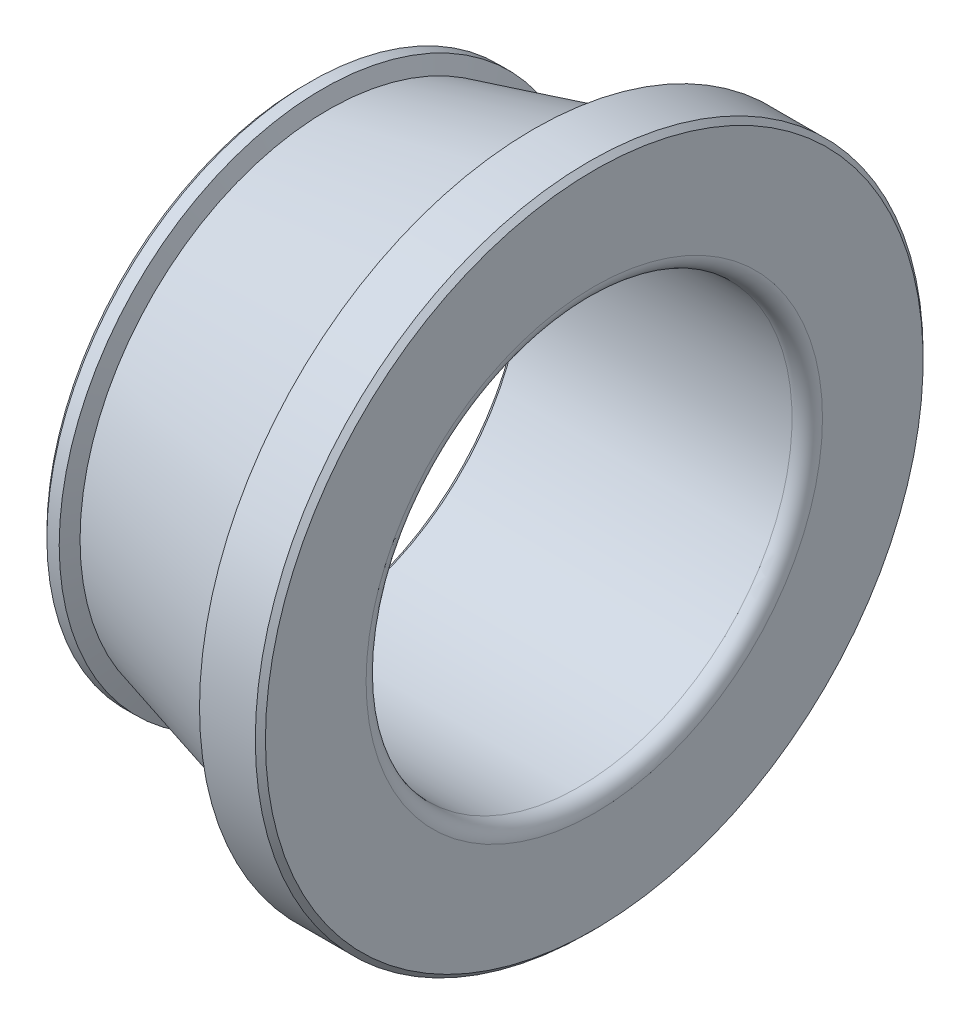
ISO-10303-21;
HEADER;
FILE_DESCRIPTION(('STEP AP214'),'2;1');
FILE_NAME('part.step','',(''),(''),'','','');
FILE_SCHEMA(('AUTOMOTIVE_DESIGN { 1 0 10303 214 1 1 1 1 }'));
ENDSEC;
DATA;
#1=APPLICATION_CONTEXT('core data for automotive mechanical design processes');
#2=APPLICATION_PROTOCOL_DEFINITION('international standard','automotive_design',2000,#1);
#3=PRODUCT_CONTEXT('',#1,'mechanical');
#4=PRODUCT('Part','Part','',(#3));
#5=PRODUCT_RELATED_PRODUCT_CATEGORY('part','',(#4));
#6=PRODUCT_DEFINITION_FORMATION('','',#4);
#7=PRODUCT_DEFINITION_CONTEXT('part definition',#1,'design');
#8=PRODUCT_DEFINITION('design','',#6,#7);
#9=PRODUCT_DEFINITION_SHAPE('','',#8);
#10=(LENGTH_UNIT() NAMED_UNIT(*) SI_UNIT(.MILLI.,.METRE.));
#11=(NAMED_UNIT(*) PLANE_ANGLE_UNIT() SI_UNIT($,.RADIAN.));
#12=(NAMED_UNIT(*) SI_UNIT($,.STERADIAN.) SOLID_ANGLE_UNIT());
#13=UNCERTAINTY_MEASURE_WITH_UNIT(LENGTH_MEASURE(1.E-05),#10,'distance_accuracy_value','');
#14=(GEOMETRIC_REPRESENTATION_CONTEXT(3) GLOBAL_UNCERTAINTY_ASSIGNED_CONTEXT((#13)) GLOBAL_UNIT_ASSIGNED_CONTEXT((#10,
#11,#12)) REPRESENTATION_CONTEXT('',''));
#15=CARTESIAN_POINT('',(0.,0.,0.));
#16=DIRECTION('',(0.,0.,1.));
#17=DIRECTION('',(1.,0.,0.));
#18=AXIS2_PLACEMENT_3D('',#15,#16,#17);
#19=CARTESIAN_POINT('',(1.25,-17.2996703748551,-16.984166666667));
#20=DIRECTION('',(-1.,0.,0.));
#21=DIRECTION('',(0.,0.,1.));
#22=AXIS2_PLACEMENT_3D('',#19,#20,#21);
#23=PLANE('',#22);
#24=CARTESIAN_POINT('',(1.25,0.,0.));
#25=DIRECTION('',(-1.,0.,0.));
#26=DIRECTION('',(0.,0.,-1.));
#27=AXIS2_PLACEMENT_3D('',#24,#25,#26);
#28=CIRCLE('',#27,16.984166666667);
#29=CARTESIAN_POINT('',(1.25,0.,-16.984166666667));
#30=VERTEX_POINT('',#29);
#31=EDGE_CURVE('E56',#30,#30,#28,.F.);
#32=ORIENTED_EDGE('',*,*,#31,.F.);
#33=EDGE_LOOP('',(#32));
#34=FACE_BOUND('',#33,.T.);
#35=CARTESIAN_POINT('',(1.25,0.,0.));
#36=DIRECTION('',(1.,0.,0.));
#37=DIRECTION('',(0.,0.,1.));
#38=AXIS2_PLACEMENT_3D('',#35,#36,#37);
#39=CIRCLE('',#38,14.333333333333);
#40=CARTESIAN_POINT('',(1.25,0.,14.333333333333));
#41=VERTEX_POINT('',#40);
#42=EDGE_CURVE('E53',#41,#41,#39,.T.);
#43=ORIENTED_EDGE('',*,*,#42,.T.);
#44=EDGE_LOOP('',(#43));
#45=FACE_BOUND('',#44,.T.);
#46=ADVANCED_FACE('F15',(#34,#45),#23,.T.);
#47=CARTESIAN_POINT('',(20.25,-22.0182252972402,21.616666666667));
#48=DIRECTION('',(1.,0.,0.));
#49=DIRECTION('',(0.,0.,-1.));
#50=AXIS2_PLACEMENT_3D('',#47,#48,#49);
#51=PLANE('',#50);
#52=CARTESIAN_POINT('',(20.25,0.,0.));
#53=DIRECTION('',(1.,0.,0.));
#54=DIRECTION('',(0.,0.,1.));
#55=AXIS2_PLACEMENT_3D('',#52,#53,#54);
#56=CIRCLE('',#55,21.616666666667);
#57=CARTESIAN_POINT('',(20.25,0.,21.616666666667));
#58=VERTEX_POINT('',#57);
#59=EDGE_CURVE('E50',#58,#58,#56,.T.);
#60=ORIENTED_EDGE('',*,*,#59,.T.);
#61=EDGE_LOOP('',(#60));
#62=FACE_BOUND('',#61,.T.);
#63=CARTESIAN_POINT('',(20.25,0.,0.));
#64=DIRECTION('',(-1.,0.,0.));
#65=DIRECTION('',(0.,0.,-1.));
#66=AXIS2_PLACEMENT_3D('',#63,#64,#65);
#67=CIRCLE('',#66,15.0000000447019);
#68=CARTESIAN_POINT('',(20.25,0.,-15.0000000447019));
#69=VERTEX_POINT('',#68);
#70=EDGE_CURVE('E47',#69,#69,#67,.F.);
#71=ORIENTED_EDGE('',*,*,#70,.F.);
#72=EDGE_LOOP('',(#71));
#73=FACE_BOUND('',#72,.T.);
#74=ADVANCED_FACE('F64',(#62,#73),#51,.T.);
#75=CARTESIAN_POINT('',(1.25,0.,0.));
#76=DIRECTION('',(-1.,0.,0.));
#77=DIRECTION('',(0.,0.,-1.));
#78=AXIS2_PLACEMENT_3D('',#75,#76,#77);
#79=CONICAL_SURFACE('',#78,14.333333333333,0.785398163396998);
#80=ORIENTED_EDGE('',*,*,#42,.F.);
#81=EDGE_LOOP('',(#80));
#82=FACE_BOUND('',#81,.T.);
#83=CARTESIAN_POINT('',(1.5833333333333,0.,0.));
#84=DIRECTION('',(1.,0.,0.));
#85=DIRECTION('',(0.,0.,1.));
#86=AXIS2_PLACEMENT_3D('',#83,#84,#85);
#87=CIRCLE('',#86,14.);
#88=CARTESIAN_POINT('',(1.5833333333333,0.,14.));
#89=VERTEX_POINT('',#88);
#90=EDGE_CURVE('E44',#89,#89,#87,.T.);
#91=ORIENTED_EDGE('',*,*,#90,.T.);
#92=EDGE_LOOP('',(#91));
#93=FACE_BOUND('',#92,.T.);
#94=ADVANCED_FACE('F68',(#82,#93),#79,.F.);
#95=CARTESIAN_POINT('',(20.25,0.,0.));
#96=DIRECTION('',(1.,0.,0.));
#97=DIRECTION('',(0.,0.,1.));
#98=AXIS2_PLACEMENT_3D('',#95,#96,#97);
#99=CYLINDRICAL_SURFACE('',#98,14.);
#100=CARTESIAN_POINT('',(19.25,0.,0.));
#101=DIRECTION('',(1.,0.,0.));
#102=DIRECTION('',(0.,0.,1.));
#103=AXIS2_PLACEMENT_3D('',#100,#101,#102);
#104=CIRCLE('',#103,14.);
#105=CARTESIAN_POINT('',(19.25,0.,14.));
#106=VERTEX_POINT('',#105);
#107=EDGE_CURVE('E41',#106,#106,#104,.T.);
#108=ORIENTED_EDGE('',*,*,#107,.T.);
#109=EDGE_LOOP('',(#108));
#110=FACE_BOUND('',#109,.T.);
#111=ORIENTED_EDGE('',*,*,#90,.F.);
#112=EDGE_LOOP('',(#111));
#113=FACE_BOUND('',#112,.T.);
#114=ADVANCED_FACE('F71',(#110,#113),#99,.F.);
#115=CARTESIAN_POINT('',(19.2500000000015,0.,0.));
#116=DIRECTION('',(1.,0.,0.));
#117=DIRECTION('',(0.,0.,1.));
#118=AXIS2_PLACEMENT_3D('',#115,#116,#117);
#119=TOROIDAL_SURFACE('',#118,14.9999999999984,0.999999999998452);
#120=ORIENTED_EDGE('',*,*,#70,.T.);
#121=EDGE_LOOP('',(#120));
#122=FACE_BOUND('',#121,.T.);
#123=ORIENTED_EDGE('',*,*,#107,.F.);
#124=EDGE_LOOP('',(#123));
#125=FACE_BOUND('',#124,.T.);
#126=ADVANCED_FACE('F76',(#122,#125),#119,.T.);
#127=CARTESIAN_POINT('',(19.916666666667,0.,0.));
#128=DIRECTION('',(-1.,0.,0.));
#129=DIRECTION('',(0.,0.,-1.));
#130=AXIS2_PLACEMENT_3D('',#127,#128,#129);
#131=CONICAL_SURFACE('',#130,21.95,0.785398163397443);
#132=ORIENTED_EDGE('',*,*,#59,.F.);
#133=EDGE_LOOP('',(#132));
#134=FACE_BOUND('',#133,.T.);
#135=CARTESIAN_POINT('',(19.916666666667,0.,0.));
#136=DIRECTION('',(1.,0.,0.));
#137=DIRECTION('',(0.,0.,1.));
#138=AXIS2_PLACEMENT_3D('',#135,#136,#137);
#139=CIRCLE('',#138,21.95);
#140=CARTESIAN_POINT('',(19.916666666667,0.,21.95));
#141=VERTEX_POINT('',#140);
#142=EDGE_CURVE('E38',#141,#141,#139,.T.);
#143=ORIENTED_EDGE('',*,*,#142,.T.);
#144=EDGE_LOOP('',(#143));
#145=FACE_BOUND('',#144,.T.);
#146=ADVANCED_FACE('F83',(#134,#145),#131,.T.);
#147=CARTESIAN_POINT('',(20.25,0.,0.));
#148=DIRECTION('',(1.,0.,0.));
#149=DIRECTION('',(0.,0.,1.));
#150=AXIS2_PLACEMENT_3D('',#147,#148,#149);
#151=CYLINDRICAL_SURFACE('',#150,21.95);
#152=CARTESIAN_POINT('',(16.250285305028,0.,0.));
#153=DIRECTION('',(1.,0.,0.));
#154=DIRECTION('',(0.,0.,1.));
#155=AXIS2_PLACEMENT_3D('',#152,#153,#154);
#156=CIRCLE('',#155,21.95);
#157=CARTESIAN_POINT('',(16.250285305028,0.,21.95));
#158=VERTEX_POINT('',#157);
#159=EDGE_CURVE('E35',#158,#158,#156,.T.);
#160=ORIENTED_EDGE('',*,*,#159,.T.);
#161=EDGE_LOOP('',(#160));
#162=FACE_BOUND('',#161,.T.);
#163=ORIENTED_EDGE('',*,*,#142,.F.);
#164=EDGE_LOOP('',(#163));
#165=FACE_BOUND('',#164,.T.);
#166=ADVANCED_FACE('F90',(#162,#165),#151,.T.);
#167=CARTESIAN_POINT('',(16.250285305028,0.,0.));
#168=DIRECTION('',(-1.,0.,0.));
#169=DIRECTION('',(0.,0.,-1.));
#170=AXIS2_PLACEMENT_3D('',#167,#168,#169);
#171=CONICAL_SURFACE('',#170,21.95,1.21183445953746);
#172=ORIENTED_EDGE('',*,*,#159,.F.);
#173=EDGE_LOOP('',(#172));
#174=FACE_BOUND('',#173,.T.);
#175=CARTESIAN_POINT('',(16.937745480872,0.,0.));
#176=DIRECTION('',(1.,0.,0.));
#177=DIRECTION('',(0.,0.,1.));
#178=AXIS2_PLACEMENT_3D('',#175,#176,#177);
#179=CIRCLE('',#178,20.117838448125);
#180=CARTESIAN_POINT('',(16.937745480872,0.,20.117838448125));
#181=VERTEX_POINT('',#180);
#182=EDGE_CURVE('E30',#181,#181,#179,.T.);
#183=ORIENTED_EDGE('',*,*,#182,.T.);
#184=EDGE_LOOP('',(#183));
#185=FACE_BOUND('',#184,.T.);
#186=ADVANCED_FACE('F94',(#174,#185),#171,.F.);
#187=CARTESIAN_POINT('',(16.937745480872,0.,0.));
#188=DIRECTION('',(1.,0.,0.));
#189=DIRECTION('',(0.,0.,1.));
#190=AXIS2_PLACEMENT_3D('',#187,#188,#189);
#191=CONICAL_SURFACE('',#190,20.117838448125,0.261799387799165);
#192=CARTESIAN_POINT('',(2.7683978191144,0.,0.));
#193=DIRECTION('',(1.,0.,0.));
#194=DIRECTION('',(0.,0.,1.));
#195=AXIS2_PLACEMENT_3D('',#192,#193,#194);
#196=CIRCLE('',#195,16.321173184881);
#197=CARTESIAN_POINT('',(2.7683978191144,0.,16.321173184881));
#198=VERTEX_POINT('',#197);
#199=EDGE_CURVE('E26',#198,#198,#196,.T.);
#200=ORIENTED_EDGE('',*,*,#199,.T.);
#201=EDGE_LOOP('',(#200));
#202=FACE_BOUND('',#201,.T.);
#203=ORIENTED_EDGE('',*,*,#182,.F.);
#204=EDGE_LOOP('',(#203));
#205=FACE_BOUND('',#204,.T.);
#206=ADVANCED_FACE('F98',(#202,#205),#191,.T.);
#207=CARTESIAN_POINT('',(2.3945579648619,0.,0.));
#208=DIRECTION('',(-1.,0.,0.));
#209=DIRECTION('',(0.,0.,-1.));
#210=AXIS2_PLACEMENT_3D('',#207,#208,#209);
#211=CONICAL_SURFACE('',#210,17.3175,1.21183445953737);
#212=ORIENTED_EDGE('',*,*,#199,.F.);
#213=EDGE_LOOP('',(#212));
#214=FACE_BOUND('',#213,.T.);
#215=CARTESIAN_POINT('',(2.3945579648619,0.,0.));
#216=DIRECTION('',(1.,0.,0.));
#217=DIRECTION('',(0.,0.,1.));
#218=AXIS2_PLACEMENT_3D('',#215,#216,#217);
#219=CIRCLE('',#218,17.3175);
#220=CARTESIAN_POINT('',(2.3945579648619,0.,17.3175));
#221=VERTEX_POINT('',#220);
#222=EDGE_CURVE('E22',#221,#221,#219,.T.);
#223=ORIENTED_EDGE('',*,*,#222,.T.);
#224=EDGE_LOOP('',(#223));
#225=FACE_BOUND('',#224,.T.);
#226=ADVANCED_FACE('F102',(#214,#225),#211,.T.);
#227=CARTESIAN_POINT('',(20.25,0.,0.));
#228=DIRECTION('',(1.,0.,0.));
#229=DIRECTION('',(0.,0.,1.));
#230=AXIS2_PLACEMENT_3D('',#227,#228,#229);
#231=CYLINDRICAL_SURFACE('',#230,17.3175);
#232=CARTESIAN_POINT('',(1.5833333333333,0.,0.));
#233=DIRECTION('',(1.,0.,0.));
#234=DIRECTION('',(0.,0.,1.));
#235=AXIS2_PLACEMENT_3D('',#232,#233,#234);
#236=CIRCLE('',#235,17.3175);
#237=CARTESIAN_POINT('',(1.5833333333333,0.,17.3175));
#238=VERTEX_POINT('',#237);
#239=EDGE_CURVE('E10',#238,#238,#236,.T.);
#240=ORIENTED_EDGE('',*,*,#239,.T.);
#241=EDGE_LOOP('',(#240));
#242=FACE_BOUND('',#241,.T.);
#243=ORIENTED_EDGE('',*,*,#222,.F.);
#244=EDGE_LOOP('',(#243));
#245=FACE_BOUND('',#244,.T.);
#246=ADVANCED_FACE('F105',(#242,#245),#231,.T.);
#247=CARTESIAN_POINT('',(1.5833333333333,0.,0.));
#248=DIRECTION('',(1.,0.,0.));
#249=DIRECTION('',(0.,1.16853294852157E-09,1.));
#250=AXIS2_PLACEMENT_3D('',#247,#248,#249);
#251=CONICAL_SURFACE('',#250,17.3175,0.785398163396998);
#252=ORIENTED_EDGE('',*,*,#31,.T.);
#253=EDGE_LOOP('',(#252));
#254=FACE_BOUND('',#253,.T.);
#255=ORIENTED_EDGE('',*,*,#239,.F.);
#256=EDGE_LOOP('',(#255));
#257=FACE_BOUND('',#256,.T.);
#258=ADVANCED_FACE('F17',(#254,#257),#251,.T.);
#259=CLOSED_SHELL('',(#46,#74,#94,#114,#126,#146,#166,#186,#206,#226,#246,#258));
#260=MANIFOLD_SOLID_BREP('B1',#259);
#261=ADVANCED_BREP_SHAPE_REPRESENTATION('',(#18,#260),#14);
#262=SHAPE_DEFINITION_REPRESENTATION(#9,#261);
ENDSEC;
END-ISO-10303-21;
